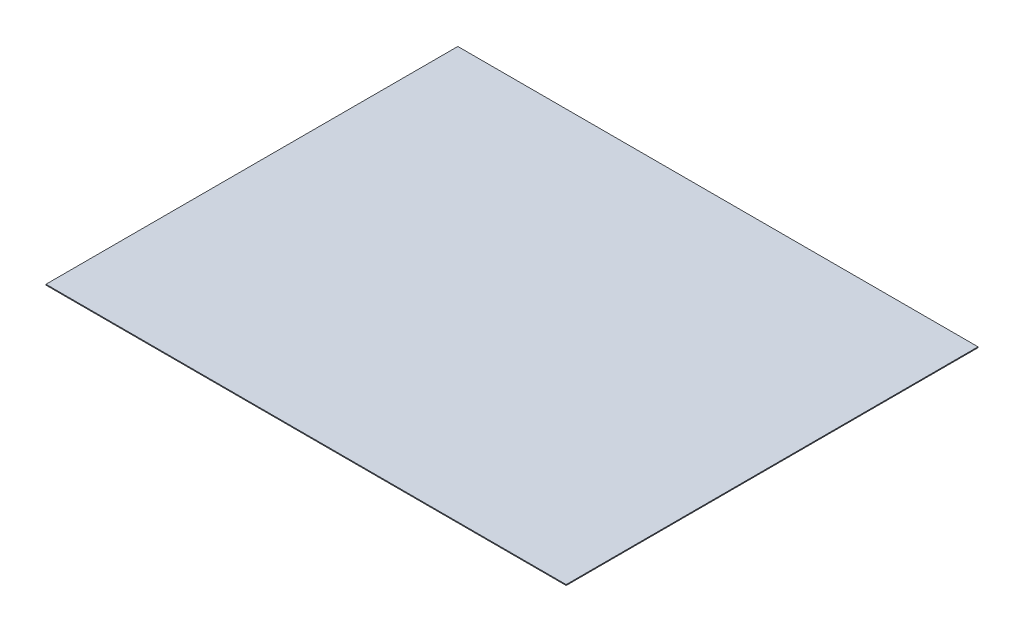
ISO-10303-21;
HEADER;
FILE_DESCRIPTION(('STEP AP214'),'2;1');
FILE_NAME('part.step','',(''),(''),'','','');
FILE_SCHEMA(('AUTOMOTIVE_DESIGN { 1 0 10303 214 1 1 1 1 }'));
ENDSEC;
DATA;
#1=APPLICATION_CONTEXT('core data for automotive mechanical design processes');
#2=APPLICATION_PROTOCOL_DEFINITION('international standard','automotive_design',2000,#1);
#3=PRODUCT_CONTEXT('',#1,'mechanical');
#4=PRODUCT('Part','Part','',(#3));
#5=PRODUCT_RELATED_PRODUCT_CATEGORY('part','',(#4));
#6=PRODUCT_DEFINITION_FORMATION('','',#4);
#7=PRODUCT_DEFINITION_CONTEXT('part definition',#1,'design');
#8=PRODUCT_DEFINITION('design','',#6,#7);
#9=PRODUCT_DEFINITION_SHAPE('','',#8);
#10=(LENGTH_UNIT() NAMED_UNIT(*) SI_UNIT(.MILLI.,.METRE.));
#11=(NAMED_UNIT(*) PLANE_ANGLE_UNIT() SI_UNIT($,.RADIAN.));
#12=(NAMED_UNIT(*) SI_UNIT($,.STERADIAN.) SOLID_ANGLE_UNIT());
#13=UNCERTAINTY_MEASURE_WITH_UNIT(LENGTH_MEASURE(1.E-05),#10,'distance_accuracy_value','');
#14=(GEOMETRIC_REPRESENTATION_CONTEXT(3) GLOBAL_UNCERTAINTY_ASSIGNED_CONTEXT((#13)) GLOBAL_UNIT_ASSIGNED_CONTEXT((#10,
#11,#12)) REPRESENTATION_CONTEXT('',''));
#15=CARTESIAN_POINT('',(0.,0.,0.));
#16=DIRECTION('',(0.,0.,1.));
#17=DIRECTION('',(1.,0.,0.));
#18=AXIS2_PLACEMENT_3D('',#15,#16,#17);
#19=CARTESIAN_POINT('',(-600.,-2.,475.));
#20=DIRECTION('',(-1.,0.,0.));
#21=DIRECTION('',(0.,0.,1.));
#22=AXIS2_PLACEMENT_3D('',#19,#20,#21);
#23=PLANE('',#22);
#24=DIRECTION('',(0.,0.,1.));
#25=VECTOR('',#24,1.);
#26=CARTESIAN_POINT('',(-600.,0.,475.));
#27=LINE('',#26,#25);
#28=CARTESIAN_POINT('',(-600.,0.,-475.));
#29=VERTEX_POINT('',#28);
#30=CARTESIAN_POINT('',(-600.,0.,475.));
#31=VERTEX_POINT('',#30);
#32=EDGE_CURVE('E105',#29,#31,#27,.T.);
#33=ORIENTED_EDGE('',*,*,#32,.F.);
#34=DIRECTION('',(0.,1.,0.));
#35=VECTOR('',#34,1.);
#36=CARTESIAN_POINT('',(-600.,-2.,-475.));
#37=LINE('',#36,#35);
#38=CARTESIAN_POINT('',(-600.,-2.,-475.));
#39=VERTEX_POINT('',#38);
#40=EDGE_CURVE('E11',#39,#29,#37,.T.);
#41=ORIENTED_EDGE('',*,*,#40,.F.);
#42=DIRECTION('',(0.,0.,1.));
#43=VECTOR('',#42,1.);
#44=CARTESIAN_POINT('',(-600.,-2.,475.));
#45=LINE('',#44,#43);
#46=CARTESIAN_POINT('',(-600.,-2.,475.));
#47=VERTEX_POINT('',#46);
#48=EDGE_CURVE('E99',#39,#47,#45,.T.);
#49=ORIENTED_EDGE('',*,*,#48,.T.);
#50=DIRECTION('',(0.,1.,0.));
#51=VECTOR('',#50,1.);
#52=CARTESIAN_POINT('',(-600.,-2.,475.));
#53=LINE('',#52,#51);
#54=EDGE_CURVE('E44',#47,#31,#53,.T.);
#55=ORIENTED_EDGE('',*,*,#54,.T.);
#56=EDGE_LOOP('',(#33,#41,#49,#55));
#57=FACE_BOUND('',#56,.T.);
#58=ADVANCED_FACE('F41',(#57),#23,.T.);
#59=CARTESIAN_POINT('',(600.,-2.,-475.));
#60=DIRECTION('',(0.,0.,-1.));
#61=DIRECTION('',(-1.,0.,0.));
#62=AXIS2_PLACEMENT_3D('',#59,#60,#61);
#63=PLANE('',#62);
#64=DIRECTION('',(-1.,0.,0.));
#65=VECTOR('',#64,1.);
#66=CARTESIAN_POINT('',(600.,0.,-475.));
#67=LINE('',#66,#65);
#68=CARTESIAN_POINT('',(600.,0.,-475.));
#69=VERTEX_POINT('',#68);
#70=EDGE_CURVE('E101',#69,#29,#67,.T.);
#71=ORIENTED_EDGE('',*,*,#70,.F.);
#72=DIRECTION('',(0.,1.,0.));
#73=VECTOR('',#72,1.);
#74=CARTESIAN_POINT('',(600.,-2.,-475.));
#75=LINE('',#74,#73);
#76=CARTESIAN_POINT('',(600.,-2.,-475.));
#77=VERTEX_POINT('',#76);
#78=EDGE_CURVE('E50',#77,#69,#75,.T.);
#79=ORIENTED_EDGE('',*,*,#78,.F.);
#80=DIRECTION('',(-1.,0.,0.));
#81=VECTOR('',#80,1.);
#82=CARTESIAN_POINT('',(600.,-2.,-475.));
#83=LINE('',#82,#81);
#84=EDGE_CURVE('E96',#77,#39,#83,.T.);
#85=ORIENTED_EDGE('',*,*,#84,.T.);
#86=ORIENTED_EDGE('',*,*,#40,.T.);
#87=EDGE_LOOP('',(#71,#79,#85,#86));
#88=FACE_BOUND('',#87,.T.);
#89=ADVANCED_FACE('F115',(#88),#63,.T.);
#90=CARTESIAN_POINT('',(600.,-2.,475.));
#91=DIRECTION('',(1.,0.,0.));
#92=DIRECTION('',(0.,0.,-1.));
#93=AXIS2_PLACEMENT_3D('',#90,#91,#92);
#94=PLANE('',#93);
#95=DIRECTION('',(0.,0.,-1.));
#96=VECTOR('',#95,1.);
#97=CARTESIAN_POINT('',(600.,0.,475.));
#98=LINE('',#97,#96);
#99=CARTESIAN_POINT('',(600.,0.,475.));
#100=VERTEX_POINT('',#99);
#101=EDGE_CURVE('E91',#100,#69,#98,.T.);
#102=ORIENTED_EDGE('',*,*,#101,.F.);
#103=DIRECTION('',(0.,1.,0.));
#104=VECTOR('',#103,1.);
#105=CARTESIAN_POINT('',(600.,-2.,475.));
#106=LINE('',#105,#104);
#107=CARTESIAN_POINT('',(600.,-2.,475.));
#108=VERTEX_POINT('',#107);
#109=EDGE_CURVE('E86',#108,#100,#106,.T.);
#110=ORIENTED_EDGE('',*,*,#109,.F.);
#111=DIRECTION('',(0.,0.,-1.));
#112=VECTOR('',#111,1.);
#113=CARTESIAN_POINT('',(600.,-2.,475.));
#114=LINE('',#113,#112);
#115=EDGE_CURVE('E89',#108,#77,#114,.T.);
#116=ORIENTED_EDGE('',*,*,#115,.T.);
#117=ORIENTED_EDGE('',*,*,#78,.T.);
#118=EDGE_LOOP('',(#102,#110,#116,#117));
#119=FACE_BOUND('',#118,.T.);
#120=ADVANCED_FACE('F88',(#119),#94,.T.);
#121=CARTESIAN_POINT('',(-600.,-2.,475.));
#122=DIRECTION('',(0.,0.,1.));
#123=DIRECTION('',(1.,0.,0.));
#124=AXIS2_PLACEMENT_3D('',#121,#122,#123);
#125=PLANE('',#124);
#126=DIRECTION('',(1.,0.,0.));
#127=VECTOR('',#126,1.);
#128=CARTESIAN_POINT('',(-600.,0.,475.));
#129=LINE('',#128,#127);
#130=EDGE_CURVE('E108',#31,#100,#129,.T.);
#131=ORIENTED_EDGE('',*,*,#130,.F.);
#132=ORIENTED_EDGE('',*,*,#54,.F.);
#133=DIRECTION('',(1.,0.,0.));
#134=VECTOR('',#133,1.);
#135=CARTESIAN_POINT('',(-600.,-2.,475.));
#136=LINE('',#135,#134);
#137=EDGE_CURVE('E95',#47,#108,#136,.T.);
#138=ORIENTED_EDGE('',*,*,#137,.T.);
#139=ORIENTED_EDGE('',*,*,#109,.T.);
#140=EDGE_LOOP('',(#131,#132,#138,#139));
#141=FACE_BOUND('',#140,.T.);
#142=ADVANCED_FACE('F98',(#141),#125,.T.);
#143=CARTESIAN_POINT('',(0.,-2.,0.));
#144=DIRECTION('',(0.,1.,0.));
#145=DIRECTION('',(0.,0.,1.));
#146=AXIS2_PLACEMENT_3D('',#143,#144,#145);
#147=PLANE('',#146);
#148=ORIENTED_EDGE('',*,*,#48,.F.);
#149=ORIENTED_EDGE('',*,*,#84,.F.);
#150=ORIENTED_EDGE('',*,*,#115,.F.);
#151=ORIENTED_EDGE('',*,*,#137,.F.);
#152=EDGE_LOOP('',(#148,#149,#150,#151));
#153=FACE_BOUND('',#152,.T.);
#154=ADVANCED_FACE('F94',(#153),#147,.F.);
#155=CARTESIAN_POINT('',(0.,0.,0.));
#156=DIRECTION('',(0.,1.,0.));
#157=DIRECTION('',(0.,0.,1.));
#158=AXIS2_PLACEMENT_3D('',#155,#156,#157);
#159=PLANE('',#158);
#160=ORIENTED_EDGE('',*,*,#32,.T.);
#161=ORIENTED_EDGE('',*,*,#130,.T.);
#162=ORIENTED_EDGE('',*,*,#101,.T.);
#163=ORIENTED_EDGE('',*,*,#70,.T.);
#164=EDGE_LOOP('',(#160,#161,#162,#163));
#165=FACE_BOUND('',#164,.T.);
#166=ADVANCED_FACE('F114',(#165),#159,.T.);
#167=CLOSED_SHELL('',(#58,#89,#120,#142,#154,#166));
#168=MANIFOLD_SOLID_BREP('B2',#167);
#169=ADVANCED_BREP_SHAPE_REPRESENTATION('',(#18,#168),#14);
#170=SHAPE_DEFINITION_REPRESENTATION(#9,#169);
ENDSEC;
END-ISO-10303-21;
